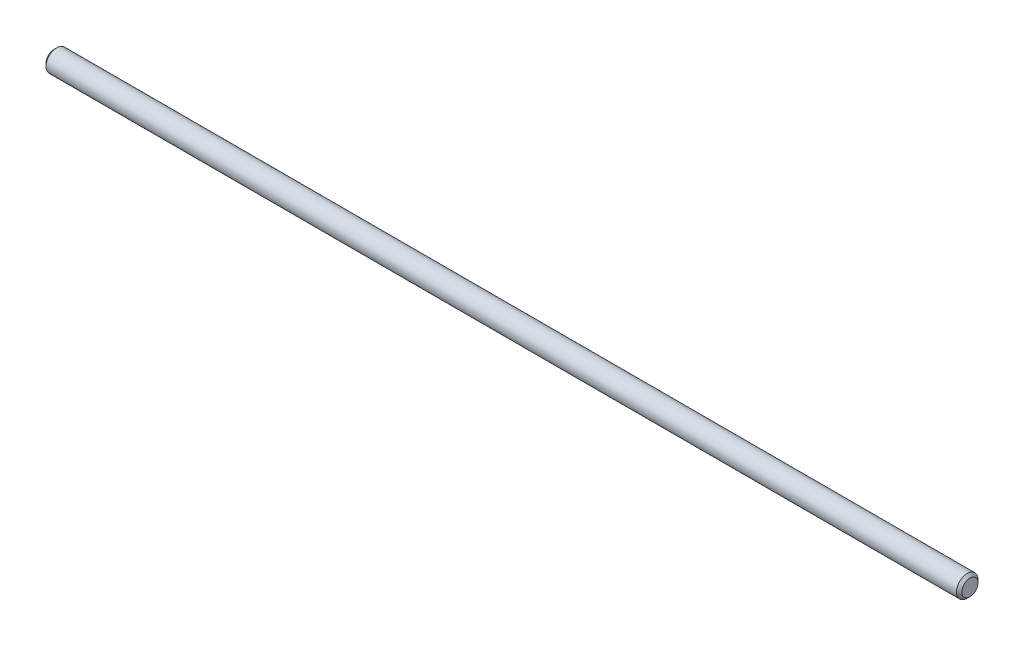
ISO-10303-21;
HEADER;
FILE_DESCRIPTION(('STEP AP214'),'2;1');
FILE_NAME('part.step','',(''),(''),'','','');
FILE_SCHEMA(('AUTOMOTIVE_DESIGN { 1 0 10303 214 1 1 1 1 }'));
ENDSEC;
DATA;
#1=APPLICATION_CONTEXT('core data for automotive mechanical design processes');
#2=APPLICATION_PROTOCOL_DEFINITION('international standard','automotive_design',2000,#1);
#3=PRODUCT_CONTEXT('',#1,'mechanical');
#4=PRODUCT('Part','Part','',(#3));
#5=PRODUCT_RELATED_PRODUCT_CATEGORY('part','',(#4));
#6=PRODUCT_DEFINITION_FORMATION('','',#4);
#7=PRODUCT_DEFINITION_CONTEXT('part definition',#1,'design');
#8=PRODUCT_DEFINITION('design','',#6,#7);
#9=PRODUCT_DEFINITION_SHAPE('','',#8);
#10=(LENGTH_UNIT() NAMED_UNIT(*) SI_UNIT(.MILLI.,.METRE.));
#11=(NAMED_UNIT(*) PLANE_ANGLE_UNIT() SI_UNIT($,.RADIAN.));
#12=(NAMED_UNIT(*) SI_UNIT($,.STERADIAN.) SOLID_ANGLE_UNIT());
#13=UNCERTAINTY_MEASURE_WITH_UNIT(LENGTH_MEASURE(1.E-05),#10,'distance_accuracy_value','');
#14=(GEOMETRIC_REPRESENTATION_CONTEXT(3) GLOBAL_UNCERTAINTY_ASSIGNED_CONTEXT((#13)) GLOBAL_UNIT_ASSIGNED_CONTEXT((#10,
#11,#12)) REPRESENTATION_CONTEXT('',''));
#15=CARTESIAN_POINT('',(0.,0.,0.));
#16=DIRECTION('',(0.,0.,1.));
#17=DIRECTION('',(1.,0.,0.));
#18=AXIS2_PLACEMENT_3D('',#15,#16,#17);
#19=CARTESIAN_POINT('',(-170.,0.,0.));
#20=DIRECTION('',(1.,0.,0.));
#21=DIRECTION('',(0.,0.,-1.));
#22=AXIS2_PLACEMENT_3D('',#19,#20,#21);
#23=CYLINDRICAL_SURFACE('',#22,4.);
#24=CARTESIAN_POINT('',(-169.,0.,0.));
#25=DIRECTION('',(1.,0.,0.));
#26=DIRECTION('',(0.,0.,-1.));
#27=AXIS2_PLACEMENT_3D('',#24,#25,#26);
#28=CIRCLE('',#27,4.);
#29=CARTESIAN_POINT('',(-169.,0.,-4.));
#30=VERTEX_POINT('',#29);
#31=EDGE_CURVE('E41',#30,#30,#28,.T.);
#32=ORIENTED_EDGE('',*,*,#31,.T.);
#33=EDGE_LOOP('',(#32));
#34=FACE_BOUND('',#33,.T.);
#35=CARTESIAN_POINT('',(169.,0.,0.));
#36=DIRECTION('',(1.,0.,0.));
#37=DIRECTION('',(0.,0.,-1.));
#38=AXIS2_PLACEMENT_3D('',#35,#36,#37);
#39=CIRCLE('',#38,4.);
#40=CARTESIAN_POINT('',(169.,0.,-4.));
#41=VERTEX_POINT('',#40);
#42=EDGE_CURVE('E45',#41,#41,#39,.F.);
#43=ORIENTED_EDGE('',*,*,#42,.T.);
#44=EDGE_LOOP('',(#43));
#45=FACE_BOUND('',#44,.T.);
#46=ADVANCED_FACE('F30',(#34,#45),#23,.T.);
#47=CARTESIAN_POINT('',(-170.,0.,0.));
#48=DIRECTION('',(1.,0.,0.));
#49=DIRECTION('',(0.,0.,-1.));
#50=AXIS2_PLACEMENT_3D('',#47,#48,#49);
#51=PLANE('',#50);
#52=CARTESIAN_POINT('',(-170.,0.,0.));
#53=DIRECTION('',(1.,0.,0.));
#54=DIRECTION('',(0.,0.,-1.));
#55=AXIS2_PLACEMENT_3D('',#52,#53,#54);
#56=CIRCLE('',#55,3.00000000000003);
#57=CARTESIAN_POINT('',(-170.,0.,-3.00000000000003));
#58=VERTEX_POINT('',#57);
#59=EDGE_CURVE('E37',#58,#58,#56,.F.);
#60=ORIENTED_EDGE('',*,*,#59,.T.);
#61=EDGE_LOOP('',(#60));
#62=FACE_BOUND('',#61,.T.);
#63=ADVANCED_FACE('F61',(#62),#51,.F.);
#64=CARTESIAN_POINT('',(170.,0.,0.));
#65=DIRECTION('',(1.,0.,0.));
#66=DIRECTION('',(0.,0.,-1.));
#67=AXIS2_PLACEMENT_3D('',#64,#65,#66);
#68=PLANE('',#67);
#69=CARTESIAN_POINT('',(170.,0.,0.));
#70=DIRECTION('',(1.,0.,0.));
#71=DIRECTION('',(0.,0.,-1.));
#72=AXIS2_PLACEMENT_3D('',#69,#70,#71);
#73=CIRCLE('',#72,3.);
#74=CARTESIAN_POINT('',(170.,0.,-3.));
#75=VERTEX_POINT('',#74);
#76=EDGE_CURVE('E10',#75,#75,#73,.T.);
#77=ORIENTED_EDGE('',*,*,#76,.T.);
#78=EDGE_LOOP('',(#77));
#79=FACE_BOUND('',#78,.T.);
#80=ADVANCED_FACE('F58',(#79),#68,.T.);
#81=CARTESIAN_POINT('',(-169.,0.,0.));
#82=DIRECTION('',(1.,0.,0.));
#83=DIRECTION('',(0.,0.,-1.));
#84=AXIS2_PLACEMENT_3D('',#81,#82,#83);
#85=CONICAL_SURFACE('',#84,4.,0.785398163397447);
#86=ORIENTED_EDGE('',*,*,#59,.F.);
#87=EDGE_LOOP('',(#86));
#88=FACE_BOUND('',#87,.T.);
#89=ORIENTED_EDGE('',*,*,#31,.F.);
#90=EDGE_LOOP('',(#89));
#91=FACE_BOUND('',#90,.T.);
#92=ADVANCED_FACE('F54',(#88,#91),#85,.T.);
#93=CARTESIAN_POINT('',(170.,0.,0.));
#94=DIRECTION('',(-1.,0.,0.));
#95=DIRECTION('',(0.,0.,1.));
#96=AXIS2_PLACEMENT_3D('',#93,#94,#95);
#97=CONICAL_SURFACE('',#96,3.,0.785398163397475);
#98=ORIENTED_EDGE('',*,*,#42,.F.);
#99=EDGE_LOOP('',(#98));
#100=FACE_BOUND('',#99,.T.);
#101=ORIENTED_EDGE('',*,*,#76,.F.);
#102=EDGE_LOOP('',(#101));
#103=FACE_BOUND('',#102,.T.);
#104=ADVANCED_FACE('F32',(#100,#103),#97,.T.);
#105=CLOSED_SHELL('',(#46,#63,#80,#92,#104));
#106=MANIFOLD_SOLID_BREP('B2',#105);
#107=ADVANCED_BREP_SHAPE_REPRESENTATION('',(#18,#106),#14);
#108=SHAPE_DEFINITION_REPRESENTATION(#9,#107);
ENDSEC;
END-ISO-10303-21;
